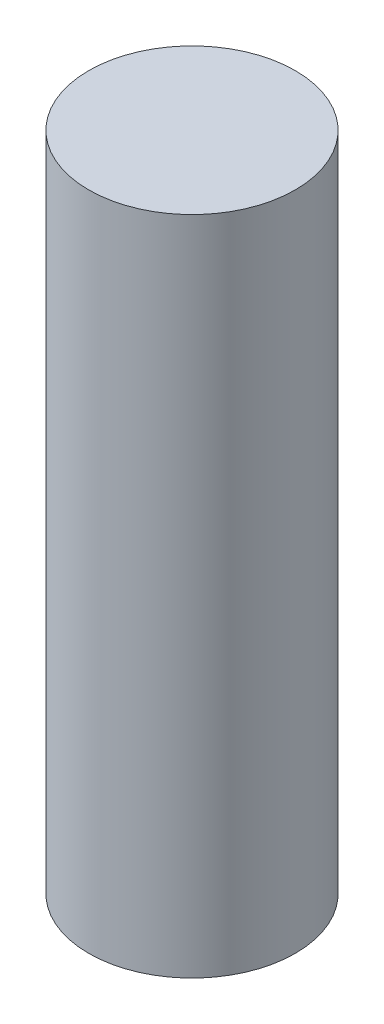
ISO-10303-21;
HEADER;
FILE_DESCRIPTION(('STEP AP214'),'2;1');
FILE_NAME('part.step','',(''),(''),'','','');
FILE_SCHEMA(('AUTOMOTIVE_DESIGN { 1 0 10303 214 1 1 1 1 }'));
ENDSEC;
DATA;
#1=APPLICATION_CONTEXT('core data for automotive mechanical design processes');
#2=APPLICATION_PROTOCOL_DEFINITION('international standard','automotive_design',2000,#1);
#3=PRODUCT_CONTEXT('',#1,'mechanical');
#4=PRODUCT('Part','Part','',(#3));
#5=PRODUCT_RELATED_PRODUCT_CATEGORY('part','',(#4));
#6=PRODUCT_DEFINITION_FORMATION('','',#4);
#7=PRODUCT_DEFINITION_CONTEXT('part definition',#1,'design');
#8=PRODUCT_DEFINITION('design','',#6,#7);
#9=PRODUCT_DEFINITION_SHAPE('','',#8);
#10=(LENGTH_UNIT() NAMED_UNIT(*) SI_UNIT(.MILLI.,.METRE.));
#11=(NAMED_UNIT(*) PLANE_ANGLE_UNIT() SI_UNIT($,.RADIAN.));
#12=(NAMED_UNIT(*) SI_UNIT($,.STERADIAN.) SOLID_ANGLE_UNIT());
#13=UNCERTAINTY_MEASURE_WITH_UNIT(LENGTH_MEASURE(1.E-05),#10,'distance_accuracy_value','');
#14=(GEOMETRIC_REPRESENTATION_CONTEXT(3) GLOBAL_UNCERTAINTY_ASSIGNED_CONTEXT((#13)) GLOBAL_UNIT_ASSIGNED_CONTEXT((#10,
#11,#12)) REPRESENTATION_CONTEXT('',''));
#15=CARTESIAN_POINT('',(0.,0.,0.));
#16=DIRECTION('',(0.,0.,1.));
#17=DIRECTION('',(1.,0.,0.));
#18=AXIS2_PLACEMENT_3D('',#15,#16,#17);
#19=CARTESIAN_POINT('',(0.,25.4,0.));
#20=DIRECTION('',(0.,-1.,0.));
#21=DIRECTION('',(0.,0.,-1.));
#22=AXIS2_PLACEMENT_3D('',#19,#20,#21);
#23=CYLINDRICAL_SURFACE('',#22,3.96875);
#24=CARTESIAN_POINT('',(0.,25.4,0.));
#25=DIRECTION('',(0.,1.,0.));
#26=DIRECTION('',(0.,0.,1.));
#27=AXIS2_PLACEMENT_3D('',#24,#25,#26);
#28=CIRCLE('',#27,3.96875);
#29=CARTESIAN_POINT('',(0.,25.4,3.96875));
#30=VERTEX_POINT('',#29);
#31=EDGE_CURVE('E10',#30,#30,#28,.T.);
#32=ORIENTED_EDGE('',*,*,#31,.F.);
#33=EDGE_LOOP('',(#32));
#34=FACE_BOUND('',#33,.T.);
#35=CARTESIAN_POINT('',(0.,0.,0.));
#36=DIRECTION('',(0.,1.,0.));
#37=DIRECTION('',(0.,0.,1.));
#38=AXIS2_PLACEMENT_3D('',#35,#36,#37);
#39=CIRCLE('',#38,3.96875);
#40=CARTESIAN_POINT('',(0.,0.,3.96875));
#41=VERTEX_POINT('',#40);
#42=EDGE_CURVE('E34',#41,#41,#39,.T.);
#43=ORIENTED_EDGE('',*,*,#42,.T.);
#44=EDGE_LOOP('',(#43));
#45=FACE_BOUND('',#44,.T.);
#46=ADVANCED_FACE('F31',(#34,#45),#23,.T.);
#47=CARTESIAN_POINT('',(0.,25.4,0.));
#48=DIRECTION('',(0.,1.,0.));
#49=DIRECTION('',(0.,0.,1.));
#50=AXIS2_PLACEMENT_3D('',#47,#48,#49);
#51=PLANE('',#50);
#52=ORIENTED_EDGE('',*,*,#31,.T.);
#53=EDGE_LOOP('',(#52));
#54=FACE_BOUND('',#53,.T.);
#55=ADVANCED_FACE('F46',(#54),#51,.T.);
#56=CARTESIAN_POINT('',(0.,0.,0.));
#57=DIRECTION('',(0.,1.,0.));
#58=DIRECTION('',(0.,0.,1.));
#59=AXIS2_PLACEMENT_3D('',#56,#57,#58);
#60=PLANE('',#59);
#61=ORIENTED_EDGE('',*,*,#42,.F.);
#62=EDGE_LOOP('',(#61));
#63=FACE_BOUND('',#62,.T.);
#64=ADVANCED_FACE('F44',(#63),#60,.F.);
#65=CLOSED_SHELL('',(#46,#55,#64));
#66=MANIFOLD_SOLID_BREP('B2',#65);
#67=ADVANCED_BREP_SHAPE_REPRESENTATION('',(#18,#66),#14);
#68=SHAPE_DEFINITION_REPRESENTATION(#9,#67);
ENDSEC;
END-ISO-10303-21;
